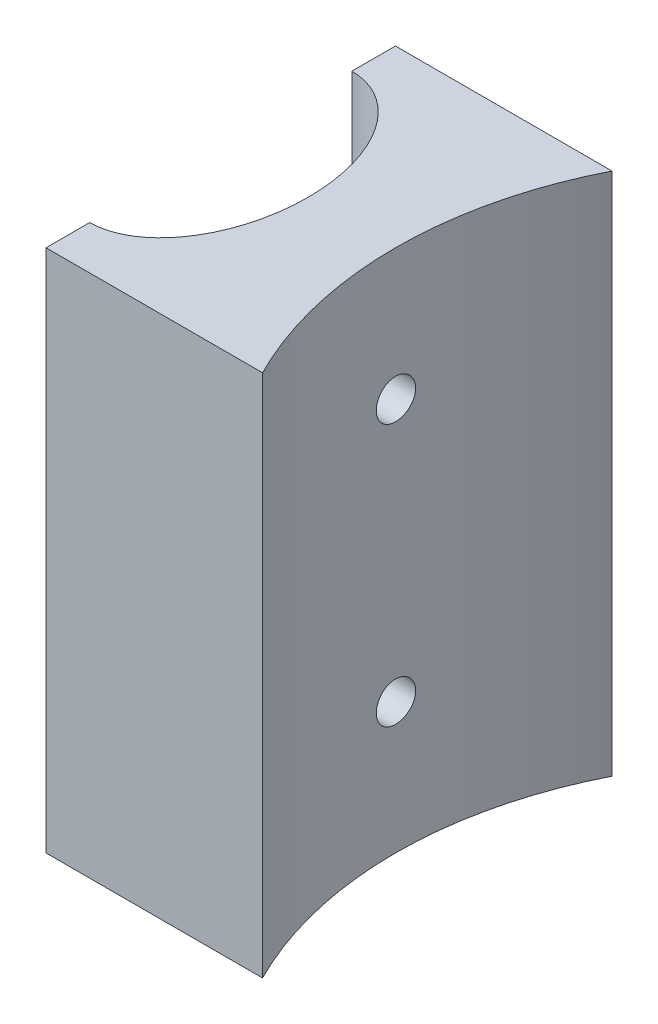
ISO-10303-21;
HEADER;
FILE_DESCRIPTION(('STEP AP214'),'2;1');
FILE_NAME('part.step','',(''),(''),'','','');
FILE_SCHEMA(('AUTOMOTIVE_DESIGN { 1 0 10303 214 1 1 1 1 }'));
ENDSEC;
DATA;
#1=APPLICATION_CONTEXT('core data for automotive mechanical design processes');
#2=APPLICATION_PROTOCOL_DEFINITION('international standard','automotive_design',2000,#1);
#3=PRODUCT_CONTEXT('',#1,'mechanical');
#4=PRODUCT('Part','Part','',(#3));
#5=PRODUCT_RELATED_PRODUCT_CATEGORY('part','',(#4));
#6=PRODUCT_DEFINITION_FORMATION('','',#4);
#7=PRODUCT_DEFINITION_CONTEXT('part definition',#1,'design');
#8=PRODUCT_DEFINITION('design','',#6,#7);
#9=PRODUCT_DEFINITION_SHAPE('','',#8);
#10=(LENGTH_UNIT() NAMED_UNIT(*) SI_UNIT(.MILLI.,.METRE.));
#11=(NAMED_UNIT(*) PLANE_ANGLE_UNIT() SI_UNIT($,.RADIAN.));
#12=(NAMED_UNIT(*) SI_UNIT($,.STERADIAN.) SOLID_ANGLE_UNIT());
#13=UNCERTAINTY_MEASURE_WITH_UNIT(LENGTH_MEASURE(1.E-05),#10,'distance_accuracy_value','');
#14=(GEOMETRIC_REPRESENTATION_CONTEXT(3) GLOBAL_UNCERTAINTY_ASSIGNED_CONTEXT((#13)) GLOBAL_UNIT_ASSIGNED_CONTEXT((#10,
#11,#12)) REPRESENTATION_CONTEXT('',''));
#15=CARTESIAN_POINT('',(0.,0.,0.));
#16=DIRECTION('',(0.,0.,1.));
#17=DIRECTION('',(1.,0.,0.));
#18=AXIS2_PLACEMENT_3D('',#15,#16,#17);
#19=CARTESIAN_POINT('',(-64.1998321537616,60.,0.));
#20=DIRECTION('',(0.,1.,0.));
#21=DIRECTION('',(0.,0.,-1.));
#22=AXIS2_PLACEMENT_3D('',#19,#20,#21);
#23=ELLIPSE('',#22,15.,10.);
#24=DIRECTION('',(0.,-1.,0.));
#25=VECTOR('',#24,1.);
#26=SURFACE_OF_LINEAR_EXTRUSION('',#23,#25);
#27=CARTESIAN_POINT('',(-54.3129721871191,45.,-2.24999999999999));
#28=CARTESIAN_POINT('',(-54.3129706872666,44.8739592523668,-2.24999454023008));
#29=CARTESIAN_POINT('',(-54.3118893348429,44.7478352137008,-2.23937347601886));
#30=CARTESIAN_POINT('',(-54.3076825072295,44.4990842417355,-2.19716456045317));
#31=CARTESIAN_POINT('',(-54.3045547802726,44.3764613162571,-2.16555361190786));
#32=CARTESIAN_POINT('',(-54.2966159529565,44.1383509595851,-2.08229495381813));
#33=CARTESIAN_POINT('',(-54.2918058771812,44.0228592356021,-2.03065943755707));
#34=CARTESIAN_POINT('',(-54.2810489830644,43.8022065304441,-1.9088406674487));
#35=CARTESIAN_POINT('',(-54.2751023899888,43.6970435082877,-1.83866108811767));
#36=CARTESIAN_POINT('',(-54.2627203591001,43.4996213484624,-1.68146848882134));
#37=CARTESIAN_POINT('',(-54.2562833840133,43.4074056016115,-1.59440108885701));
#38=CARTESIAN_POINT('',(-54.2436604444196,43.238869742639,-1.40602070373931));
#39=CARTESIAN_POINT('',(-54.2374744913362,43.1625503532773,-1.30470707120287));
#40=CARTESIAN_POINT('',(-54.226033579334,43.027825982386,-1.09044795567095));
#41=CARTESIAN_POINT('',(-54.2207805977245,42.9694588612899,-0.977478551824353));
#42=CARTESIAN_POINT('',(-54.2118109596765,42.8725383770923,-0.743280883548645));
#43=CARTESIAN_POINT('',(-54.2080942657743,42.8339845308216,-0.622052820597957));
#44=CARTESIAN_POINT('',(-54.2026235678418,42.7779113778186,-0.375214780381486));
#45=CARTESIAN_POINT('',(-54.2008629583611,42.7603212644838,-0.249621036586616));
#46=CARTESIAN_POINT('',(-54.1994785442416,42.7464556746743,0.00274753546304236));
#47=CARTESIAN_POINT('',(-54.1998546843143,42.7501796466982,0.129522333073351));
#48=CARTESIAN_POINT('',(-54.2026964369109,42.7787795846845,0.380178209009529));
#49=CARTESIAN_POINT('',(-54.2051545989741,42.8035801297554,0.504067989106644));
#50=CARTESIAN_POINT('',(-54.2118779649085,42.873511630149,0.745917749903435));
#51=CARTESIAN_POINT('',(-54.2161431919209,42.918642845827,0.863877654643423));
#52=CARTESIAN_POINT('',(-54.226017317538,43.0280368951439,1.0907565636833));
#53=CARTESIAN_POINT('',(-54.2316285523607,43.0923330402703,1.19965940041624));
#54=CARTESIAN_POINT('',(-54.2435680169262,43.2382074682986,1.40515672376701));
#55=CARTESIAN_POINT('',(-54.2498962678837,43.3197862626164,1.50175084601843));
#56=CARTESIAN_POINT('',(-54.2625935628969,43.4983362274651,1.68033271854842));
#57=CARTESIAN_POINT('',(-54.2689626641709,43.5953733033282,1.76225458531803));
#58=CARTESIAN_POINT('',(-54.2809951255089,43.8018570400412,1.90865676127198));
#59=CARTESIAN_POINT('',(-54.2866584844155,43.9113037212415,1.97313704185348));
#60=CARTESIAN_POINT('',(-54.2966359742979,44.1395537855823,2.08282690545579));
#61=CARTESIAN_POINT('',(-54.3009497867868,44.2583593691144,2.12803194051513));
#62=CARTESIAN_POINT('',(-54.3077301675247,44.50192746667,2.19783343771165));
#63=CARTESIAN_POINT('',(-54.3101967932222,44.6266897953076,2.2224305407679));
#64=CARTESIAN_POINT('',(-54.3129911866722,44.8780464433999,2.25023243673036));
#65=CARTESIAN_POINT('',(-54.3133282502384,45.0046303798506,2.25353020538985));
#66=CARTESIAN_POINT('',(-54.311849524196,45.25654901479,2.23888399232438));
#67=CARTESIAN_POINT('',(-54.3100337638153,45.3818837302156,2.22094029898678));
#68=CARTESIAN_POINT('',(-54.30446436498,45.6274733142993,2.16439873305868));
#69=CARTESIAN_POINT('',(-54.3007148790374,45.7477384731619,2.12584511208666));
#70=CARTESIAN_POINT('',(-54.2917071125229,45.9800949527236,2.02922307657604));
#71=CARTESIAN_POINT('',(-54.2864487965996,46.0921860818313,1.97115420479741));
#72=CARTESIAN_POINT('',(-54.2749964632433,46.305438569676,1.83691567640139));
#73=CARTESIAN_POINT('',(-54.2687992709233,46.4065607654607,1.76068408014213));
#74=CARTESIAN_POINT('',(-54.2561797458112,46.5946072833961,1.59237278525056));
#75=CARTESIAN_POINT('',(-54.2497574074585,46.6815312545915,1.50029269498653));
#76=CARTESIAN_POINT('',(-54.2373829377827,46.8390331808175,1.30249631954755));
#77=CARTESIAN_POINT('',(-54.2314325962882,46.9095507086041,1.19673178970384));
#78=CARTESIAN_POINT('',(-54.2206958782614,47.0318219027703,0.974807281629379));
#79=CARTESIAN_POINT('',(-54.2159094856004,47.0835758291606,0.858647447476102));
#80=CARTESIAN_POINT('',(-54.2080445793747,47.1667476029234,0.61944279914697));
#81=CARTESIAN_POINT('',(-54.204962975207,47.1982022680923,0.496410892264348));
#82=CARTESIAN_POINT('',(-54.2008392974862,47.2400032140212,0.246779593811854));
#83=CARTESIAN_POINT('',(-54.1997971668522,47.250350085548,0.12018030218679));
#84=CARTESIAN_POINT('',(-54.1998687973658,47.2496333484126,-0.13240293968782));
#85=CARTESIAN_POINT('',(-54.200973182774,47.2386628516567,-0.258387167165245));
#86=CARTESIAN_POINT('',(-54.2051963930277,47.1958180729749,-0.506713433461588));
#87=CARTESIAN_POINT('',(-54.2083152191077,47.1639437782382,-0.629055470048357));
#88=CARTESIAN_POINT('',(-54.2162207314384,47.0802220971701,-0.866623647317668));
#89=CARTESIAN_POINT('',(-54.2210071890169,47.0283774491488,-0.981850761077351));
#90=CARTESIAN_POINT('',(-54.2317177808872,46.9061968740451,-1.20198185504934));
#91=CARTESIAN_POINT('',(-54.2376419086402,46.8358610532411,-1.30688589458899));
#92=CARTESIAN_POINT('',(-54.2499975440924,46.6783459775815,-1.50387009383773));
#93=CARTESIAN_POINT('',(-54.2564310723443,46.5910974320206,-1.59589472063789));
#94=CARTESIAN_POINT('',(-54.2690641081727,46.4023698867624,-1.76403882204443));
#95=CARTESIAN_POINT('',(-54.2752635591578,46.3008874734352,-1.840154470352));
#96=CARTESIAN_POINT('',(-54.2867418183695,46.0862869292685,-1.97447506707629));
#97=CARTESIAN_POINT('',(-54.2920182165752,45.9731395296529,-2.03263342418632));
#98=CARTESIAN_POINT('',(-54.3010208352089,45.7387042205194,-2.12904785076018));
#99=CARTESIAN_POINT('',(-54.3047488030047,45.6174256673795,-2.1673263664488));
#100=CARTESIAN_POINT('',(-54.3092892487963,45.4128841769473,-2.21335293233092));
#101=CARTESIAN_POINT('',(-54.3106637572163,45.3309288090992,-2.22707678698007));
#102=CARTESIAN_POINT('',(-54.312505718371,45.1659943352491,-2.24540209934365));
#103=CARTESIAN_POINT('',(-54.3129731749789,45.0830152336201,-2.25000359601225));
#104=CARTESIAN_POINT('',(-54.3129721871191,45.,-2.24999999999999));
#105=B_SPLINE_CURVE_WITH_KNOTS('',3,(#27,#28,#29,#30,#31,#32,#33,#34,#35,#36,#37,#38,#39,#40,
#41,#42,#43,#44,#45,#46,#47,#48,#49,#50,#51,#52,#53,#54,#55,#56,#57,#58,#59,#60,#61,#62,#63,#64,
#65,#66,#67,#68,#69,#70,#71,#72,#73,#74,#75,#76,#77,#78,#79,#80,#81,#82,#83,#84,#85,#86,#87,#88,
#89,#90,#91,#92,#93,#94,#95,#96,#97,#98,#99,#100,#101,#102,#103,#104),.UNSPECIFIED.,.T.,.F.,(4,
2,2,2,2,2,2,2,2,2,2,2,2,2,2,2,2,2,2,2,2,2,2,2,2,2,2,2,2,2,2,2,2,2,2,2,2,2,4),(0.,
0.377819073818889,0.756054588858869,1.13406015088811,1.51199086700333,1.89115938009317,
2.2703451290836,2.65032516369576,3.03029593162446,3.40897964897296,3.78765356793336,
4.16497810970032,4.54230748363547,4.9202965748471,5.2982968528114,5.67795410512996,
6.05761198005278,6.43735938510403,6.81709497934432,7.19517182680597,7.5732435413192,
7.95050673859512,8.3277787757195,8.70635630419786,9.08494318903928,9.46490313597504,
9.84485781753408,10.2241214047119,10.603374376883,10.9809745371524,11.3585749288327,
11.736123562834,12.1136700269133,12.4927972850532,12.8720156231524,13.2522097556177,
13.6319736744608,13.8808207592518,14.1296667814167),.UNSPECIFIED.);
#106=CARTESIAN_POINT('',(-54.3129721871191,45.,-2.24999999999999));
#107=VERTEX_POINT('',#106);
#108=EDGE_CURVE('E46',#107,#107,#105,.T.);
#109=ORIENTED_EDGE('',*,*,#108,.F.);
#110=EDGE_LOOP('',(#109));
#111=FACE_BOUND('',#110,.T.);
#112=CARTESIAN_POINT('',(-54.3129721871191,15.,-2.24999999999999));
#113=CARTESIAN_POINT('',(-54.3129706872666,14.8739592523668,-2.24999454023008));
#114=CARTESIAN_POINT('',(-54.3118893348429,14.7478352137008,-2.23937347601886));
#115=CARTESIAN_POINT('',(-54.3076825072295,14.4990842417355,-2.19716456045318));
#116=CARTESIAN_POINT('',(-54.3045547802726,14.3764613162571,-2.16555361190788));
#117=CARTESIAN_POINT('',(-54.2966159529565,14.1383509595851,-2.08229495381814));
#118=CARTESIAN_POINT('',(-54.2918058771812,14.0228592356021,-2.03065943755708));
#119=CARTESIAN_POINT('',(-54.2810489830643,13.8022065304441,-1.90884066744871));
#120=CARTESIAN_POINT('',(-54.2751023899888,13.6970435082877,-1.83866108811768));
#121=CARTESIAN_POINT('',(-54.2627203591001,13.4996213484624,-1.68146848882135));
#122=CARTESIAN_POINT('',(-54.2562833840133,13.4074056016115,-1.59440108885702));
#123=CARTESIAN_POINT('',(-54.2436604444196,13.238869742639,-1.40602070373931));
#124=CARTESIAN_POINT('',(-54.2374744913362,13.1625503532773,-1.30470707120289));
#125=CARTESIAN_POINT('',(-54.226033579334,13.027825982386,-1.09044795567097));
#126=CARTESIAN_POINT('',(-54.2207805977245,12.9694588612899,-0.977478551824365));
#127=CARTESIAN_POINT('',(-54.2118109596765,12.8725383770923,-0.743280883548656));
#128=CARTESIAN_POINT('',(-54.2080942657743,12.8339845308216,-0.622052820597969));
#129=CARTESIAN_POINT('',(-54.2026235678418,12.7779113778186,-0.3752147803815));
#130=CARTESIAN_POINT('',(-54.2008629583611,12.7603212644838,-0.24962103658663));
#131=CARTESIAN_POINT('',(-54.1994785442416,12.7464556746743,0.00274753546302924));
#132=CARTESIAN_POINT('',(-54.1998546843143,12.7501796466982,0.129522333073338));
#133=CARTESIAN_POINT('',(-54.2026964369109,12.7787795846845,0.380178209009516));
#134=CARTESIAN_POINT('',(-54.2051545989741,12.8035801297554,0.504067989106631));
#135=CARTESIAN_POINT('',(-54.2118779649085,12.873511630149,0.745917749903422));
#136=CARTESIAN_POINT('',(-54.2161431919209,12.9186428458269,0.86387765464341));
#137=CARTESIAN_POINT('',(-54.226017317538,13.0280368951439,1.09075656368329));
#138=CARTESIAN_POINT('',(-54.2316285523607,13.0923330402703,1.19965940041623));
#139=CARTESIAN_POINT('',(-54.2435680169262,13.2382074682985,1.40515672376699));
#140=CARTESIAN_POINT('',(-54.2498962678837,13.3197862626164,1.50175084601842));
#141=CARTESIAN_POINT('',(-54.2625935628969,13.4983362274651,1.68033271854841));
#142=CARTESIAN_POINT('',(-54.2689626641709,13.5953733033282,1.76225458531803));
#143=CARTESIAN_POINT('',(-54.2809951255089,13.8018570400412,1.90865676127198));
#144=CARTESIAN_POINT('',(-54.2866584844155,13.9113037212415,1.97313704185348));
#145=CARTESIAN_POINT('',(-54.2966359742979,14.1395537855823,2.08282690545579));
#146=CARTESIAN_POINT('',(-54.3009497867868,14.2583593691144,2.12803194051513));
#147=CARTESIAN_POINT('',(-54.3077301675247,14.50192746667,2.19783343771165));
#148=CARTESIAN_POINT('',(-54.3101967932222,14.6266897953076,2.2224305407679));
#149=CARTESIAN_POINT('',(-54.3129911866722,14.8780464433999,2.25023243673036));
#150=CARTESIAN_POINT('',(-54.3133282502384,15.0046303798505,2.25353020538985));
#151=CARTESIAN_POINT('',(-54.311849524196,15.25654901479,2.23888399232439));
#152=CARTESIAN_POINT('',(-54.3100337638153,15.3818837302156,2.22094029898678));
#153=CARTESIAN_POINT('',(-54.30446436498,15.6274733142993,2.16439873305868));
#154=CARTESIAN_POINT('',(-54.3007148790374,15.7477384731619,2.12584511208666));
#155=CARTESIAN_POINT('',(-54.2917071125229,15.9800949527236,2.02922307657604));
#156=CARTESIAN_POINT('',(-54.2864487965996,16.0921860818313,1.97115420479742));
#157=CARTESIAN_POINT('',(-54.2749964632433,16.3054385696761,1.8369156764014));
#158=CARTESIAN_POINT('',(-54.2687992709233,16.4065607654607,1.76068408014214));
#159=CARTESIAN_POINT('',(-54.2561797458112,16.5946072833961,1.59237278525056));
#160=CARTESIAN_POINT('',(-54.2497574074585,16.6815312545915,1.50029269498652));
#161=CARTESIAN_POINT('',(-54.2373829377827,16.8390331808175,1.30249631954755));
#162=CARTESIAN_POINT('',(-54.2314325962882,16.9095507086041,1.19673178970384));
#163=CARTESIAN_POINT('',(-54.2206958782614,17.0318219027703,0.974807281629389));
#164=CARTESIAN_POINT('',(-54.2159094856004,17.0835758291606,0.858647447476114));
#165=CARTESIAN_POINT('',(-54.2080445793747,17.1667476029234,0.619442799146983));
#166=CARTESIAN_POINT('',(-54.204962975207,17.1982022680923,0.496410892264362));
#167=CARTESIAN_POINT('',(-54.2008392974862,17.2400032140212,0.246779593811868));
#168=CARTESIAN_POINT('',(-54.1997971668522,17.250350085548,0.120180302186804));
#169=CARTESIAN_POINT('',(-54.1998687973658,17.2496333484126,-0.132402939687807));
#170=CARTESIAN_POINT('',(-54.200973182774,17.2386628516567,-0.258387167165233));
#171=CARTESIAN_POINT('',(-54.2051963930277,17.1958180729749,-0.506713433461575));
#172=CARTESIAN_POINT('',(-54.2083152191077,17.1639437782382,-0.629055470048343));
#173=CARTESIAN_POINT('',(-54.2162207314384,17.0802220971701,-0.866623647317656));
#174=CARTESIAN_POINT('',(-54.2210071890169,17.0283774491488,-0.981850761077344));
#175=CARTESIAN_POINT('',(-54.2317177808872,16.9061968740451,-1.20198185504934));
#176=CARTESIAN_POINT('',(-54.2376419086402,16.8358610532411,-1.30688589458899));
#177=CARTESIAN_POINT('',(-54.2499975440924,16.6783459775815,-1.50387009383773));
#178=CARTESIAN_POINT('',(-54.2564310723443,16.5910974320206,-1.59589472063789));
#179=CARTESIAN_POINT('',(-54.2690641081727,16.4023698867624,-1.76403882204443));
#180=CARTESIAN_POINT('',(-54.2752635591578,16.3008874734352,-1.840154470352));
#181=CARTESIAN_POINT('',(-54.2867418183695,16.0862869292686,-1.97447506707628));
#182=CARTESIAN_POINT('',(-54.2920182165752,15.9731395296529,-2.03263342418632));
#183=CARTESIAN_POINT('',(-54.3010208352089,15.7387042205194,-2.12904785076018));
#184=CARTESIAN_POINT('',(-54.3047488030047,15.6174256673795,-2.1673263664488));
#185=CARTESIAN_POINT('',(-54.3092892487963,15.4128841769473,-2.21335293233092));
#186=CARTESIAN_POINT('',(-54.3106637572163,15.3309288090992,-2.22707678698008));
#187=CARTESIAN_POINT('',(-54.312505718371,15.1659943352491,-2.24540209934365));
#188=CARTESIAN_POINT('',(-54.3129731749789,15.0830152336201,-2.25000359601226));
#189=CARTESIAN_POINT('',(-54.3129721871191,15.,-2.24999999999999));
#190=B_SPLINE_CURVE_WITH_KNOTS('',3,(#112,#113,#114,#115,#116,#117,#118,#119,#120,#121,#122,
#123,#124,#125,#126,#127,#128,#129,#130,#131,#132,#133,#134,#135,#136,#137,#138,#139,#140,#141,
#142,#143,#144,#145,#146,#147,#148,#149,#150,#151,#152,#153,#154,#155,#156,#157,#158,#159,#160,
#161,#162,#163,#164,#165,#166,#167,#168,#169,#170,#171,#172,#173,#174,#175,#176,#177,#178,#179,
#180,#181,#182,#183,#184,#185,#186,#187,#188,#189),.UNSPECIFIED.,.T.,.F.,(4,2,2,2,2,2,2,2,2,2,2,
2,2,2,2,2,2,2,2,2,2,2,2,2,2,2,2,2,2,2,2,2,2,2,2,2,2,2,4),(0.,0.377819073818889,
0.756054588858866,1.1340601508881,1.51199086700332,1.89115938009317,2.27034512908359,
2.65032516369575,3.03029593162446,3.40897964897296,3.78765356793336,4.16497810970031,
4.54230748363546,4.9202965748471,5.29829685281139,5.67795410512996,6.05761198005279,
6.43735938510404,6.81709497934432,7.19517182680597,7.5732435413192,7.95050673859512,
8.3277787757195,8.70635630419787,9.08494318903929,9.46490313597504,9.84485781753408,
10.2241214047119,10.603374376883,10.9809745371524,11.3585749288327,11.736123562834,
12.1136700269133,12.4927972850532,12.8720156231524,13.2522097556177,13.6319736744608,
13.8808207592518,14.1296667814167),.UNSPECIFIED.);
#191=CARTESIAN_POINT('',(-54.3129721871191,15.,-2.24999999999999));
#192=VERTEX_POINT('',#191);
#193=EDGE_CURVE('E164',#192,#192,#190,.T.);
#194=ORIENTED_EDGE('',*,*,#193,.F.);
#195=EDGE_LOOP('',(#194));
#196=FACE_BOUND('',#195,.T.);
#197=CARTESIAN_POINT('',(-64.1998321537616,0.,0.));
#198=DIRECTION('',(0.,1.,0.));
#199=DIRECTION('',(0.,0.,-1.));
#200=AXIS2_PLACEMENT_3D('',#197,#198,#199);
#201=ELLIPSE('',#200,15.,10.);
#202=CARTESIAN_POINT('',(-64.1998321537616,0.,15.));
#203=VERTEX_POINT('',#202);
#204=CARTESIAN_POINT('',(-64.1998321537616,0.,-15.));
#205=VERTEX_POINT('',#204);
#206=EDGE_CURVE('E135',#203,#205,#201,.T.);
#207=ORIENTED_EDGE('',*,*,#206,.F.);
#208=DIRECTION('',(0.,-1.,0.));
#209=VECTOR('',#208,1.);
#210=CARTESIAN_POINT('',(-64.1998321537616,60.,15.));
#211=LINE('',#210,#209);
#212=CARTESIAN_POINT('',(-64.1998321537616,60.,15.));
#213=VERTEX_POINT('',#212);
#214=EDGE_CURVE('E11',#213,#203,#211,.T.);
#215=ORIENTED_EDGE('',*,*,#214,.F.);
#216=CARTESIAN_POINT('',(-64.1998321537616,60.,-15.));
#217=VERTEX_POINT('',#216);
#218=EDGE_CURVE('E155',#213,#217,#23,.T.);
#219=ORIENTED_EDGE('',*,*,#218,.T.);
#220=DIRECTION('',(0.,-1.,0.));
#221=VECTOR('',#220,1.);
#222=CARTESIAN_POINT('',(-64.1998321537616,60.,-15.));
#223=LINE('',#222,#221);
#224=EDGE_CURVE('E66',#217,#205,#223,.T.);
#225=ORIENTED_EDGE('',*,*,#224,.T.);
#226=EDGE_LOOP('',(#207,#215,#219,#225));
#227=FACE_BOUND('',#226,.T.);
#228=ADVANCED_FACE('F41',(#111,#196,#227),#26,.T.);
#229=CARTESIAN_POINT('',(-64.1998321537616,60.,0.));
#230=DIRECTION('',(1.,0.,0.));
#231=DIRECTION('',(0.,0.,-1.));
#232=AXIS2_PLACEMENT_3D('',#229,#230,#231);
#233=PLANE('',#232);
#234=DIRECTION('',(0.,0.,1.));
#235=VECTOR('',#234,1.);
#236=CARTESIAN_POINT('',(-64.1998321537616,0.,0.));
#237=LINE('',#236,#235);
#238=CARTESIAN_POINT('',(-64.1998321537616,0.,20.));
#239=VERTEX_POINT('',#238);
#240=EDGE_CURVE('E138',#203,#239,#237,.T.);
#241=ORIENTED_EDGE('',*,*,#240,.T.);
#242=DIRECTION('',(0.,-1.,0.));
#243=VECTOR('',#242,1.);
#244=CARTESIAN_POINT('',(-64.1998321537616,60.,20.));
#245=LINE('',#244,#243);
#246=CARTESIAN_POINT('',(-64.1998321537616,60.,20.));
#247=VERTEX_POINT('',#246);
#248=EDGE_CURVE('E57',#247,#239,#245,.T.);
#249=ORIENTED_EDGE('',*,*,#248,.F.);
#250=DIRECTION('',(0.,0.,1.));
#251=VECTOR('',#250,1.);
#252=CARTESIAN_POINT('',(-64.1998321537616,60.,0.));
#253=LINE('',#252,#251);
#254=EDGE_CURVE('E290',#213,#247,#253,.T.);
#255=ORIENTED_EDGE('',*,*,#254,.F.);
#256=ORIENTED_EDGE('',*,*,#214,.T.);
#257=EDGE_LOOP('',(#241,#249,#255,#256));
#258=FACE_BOUND('',#257,.T.);
#259=ADVANCED_FACE('F204',(#258),#233,.F.);
#260=CARTESIAN_POINT('',(0.,60.,20.));
#261=DIRECTION('',(0.,0.,-1.));
#262=DIRECTION('',(-1.,0.,0.));
#263=AXIS2_PLACEMENT_3D('',#260,#261,#262);
#264=PLANE('',#263);
#265=DIRECTION('',(1.,0.,0.));
#266=VECTOR('',#265,1.);
#267=CARTESIAN_POINT('',(0.,0.,20.));
#268=LINE('',#267,#266);
#269=CARTESIAN_POINT('',(-39.4160520907498,0.,20.));
#270=VERTEX_POINT('',#269);
#271=EDGE_CURVE('E142',#239,#270,#268,.T.);
#272=ORIENTED_EDGE('',*,*,#271,.T.);
#273=DIRECTION('',(0.,-1.,0.));
#274=VECTOR('',#273,1.);
#275=CARTESIAN_POINT('',(-39.4160520907498,60.,20.));
#276=LINE('',#275,#274);
#277=CARTESIAN_POINT('',(-39.4160520907498,60.,20.));
#278=VERTEX_POINT('',#277);
#279=EDGE_CURVE('E114',#278,#270,#276,.T.);
#280=ORIENTED_EDGE('',*,*,#279,.F.);
#281=DIRECTION('',(1.,0.,0.));
#282=VECTOR('',#281,1.);
#283=CARTESIAN_POINT('',(0.,60.,20.));
#284=LINE('',#283,#282);
#285=EDGE_CURVE('E123',#247,#278,#284,.T.);
#286=ORIENTED_EDGE('',*,*,#285,.F.);
#287=ORIENTED_EDGE('',*,*,#248,.T.);
#288=EDGE_LOOP('',(#272,#280,#286,#287));
#289=FACE_BOUND('',#288,.T.);
#290=ADVANCED_FACE('F199',(#289),#264,.F.);
#291=CARTESIAN_POINT('',(0.,60.,0.));
#292=DIRECTION('',(0.,-1.,0.));
#293=DIRECTION('',(0.,0.,-1.));
#294=AXIS2_PLACEMENT_3D('',#291,#292,#293);
#295=CYLINDRICAL_SURFACE('',#294,44.1998321537616);
#296=CARTESIAN_POINT('',(-44.1425266882255,45.,-2.24999999999998));
#297=CARTESIAN_POINT('',(-44.142527457818,45.1262956092506,-2.24999442713911));
#298=CARTESIAN_POINT('',(-44.1430745282501,45.2526807103639,-2.23933056294759));
#299=CARTESIAN_POINT('',(-44.1452040744582,45.5019641712585,-2.19694165198085));
#300=CARTESIAN_POINT('',(-44.1467877692082,45.6248582481824,-2.16519180941065));
#301=CARTESIAN_POINT('',(-44.1508107094823,45.8635124793692,-2.08154253460701));
#302=CARTESIAN_POINT('',(-44.1532495178031,45.9792762437347,-2.02965339776952));
#303=CARTESIAN_POINT('',(-44.1587073290967,46.2004192475668,-1.90721433747127));
#304=CARTESIAN_POINT('',(-44.1617261953374,46.3058009254783,-1.83666881025444));
#305=CARTESIAN_POINT('',(-44.1680075556287,46.5033297005833,-1.67883757395632));
#306=CARTESIAN_POINT('',(-44.1712702699331,46.5954646077047,-1.59153661631729));
#307=CARTESIAN_POINT('',(-44.177669607545,46.7637805125193,-1.40270322416019));
#308=CARTESIAN_POINT('',(-44.1808062256941,46.839960858079,-1.30117020819809));
#309=CARTESIAN_POINT('',(-44.1866016205701,46.9742389013147,-1.08669080106702));
#310=CARTESIAN_POINT('',(-44.1892601454235,47.0323270792366,-0.973738442520186));
#311=CARTESIAN_POINT('',(-44.1937975398201,47.1287107849185,-0.739668658279781));
#312=CARTESIAN_POINT('',(-44.1956764154222,47.1670064664935,-0.618551296047801));
#313=CARTESIAN_POINT('',(-44.1984413086293,47.2226858367235,-0.371701952053489));
#314=CARTESIAN_POINT('',(-44.1993281938033,47.24008779946,-0.245974102065903));
#315=CARTESIAN_POINT('',(-44.2000120742315,47.2535421520233,0.00662110096752594));
#316=CARTESIAN_POINT('',(-44.1998090783036,47.2495947145811,0.133488444785809));
#317=CARTESIAN_POINT('',(-44.1983368021044,47.2204774794499,0.38463759539406));
#318=CARTESIAN_POINT('',(-44.1970685100674,47.1953273506044,0.508921689106154));
#319=CARTESIAN_POINT('',(-44.1936096331313,47.1245491441282,0.75150168034481));
#320=CARTESIAN_POINT('',(-44.1914190442614,47.0789209783353,0.869797552088355));
#321=CARTESIAN_POINT('',(-44.186360620201,46.9684594984692,1.09710643121945));
#322=CARTESIAN_POINT('',(-44.1834924692291,46.9036172259702,1.20611507791987));
#323=CARTESIAN_POINT('',(-44.1774019054214,46.7565747085047,1.41170749108833));
#324=CARTESIAN_POINT('',(-44.1741794899872,46.6743743362294,1.50829116642015));
#325=CARTESIAN_POINT('',(-44.1677389591943,46.4948378001546,1.68640669954388));
#326=CARTESIAN_POINT('',(-44.1645208528609,46.3974845712613,1.76792135741352));
#327=CARTESIAN_POINT('',(-44.1584554139715,46.1904657630216,1.91345244421067));
#328=CARTESIAN_POINT('',(-44.1556080815165,46.0808001803134,1.97746886836012));
#329=CARTESIAN_POINT('',(-44.1506055642542,45.8522592519534,2.08618481168339));
#330=CARTESIAN_POINT('',(-44.1484504028022,45.7333835957012,2.13088367905763));
#331=CARTESIAN_POINT('',(-44.1450761544198,45.4898016742682,2.19968415845908));
#332=CARTESIAN_POINT('',(-44.143857060192,45.3650954545494,2.22378593105792));
#333=CARTESIAN_POINT('',(-44.1424937742406,45.113542202159,2.25068677682164));
#334=CARTESIAN_POINT('',(-44.142348377821,44.9866977288993,2.25350972504169));
#335=CARTESIAN_POINT('',(-44.143145738618,44.7343369052879,2.23783509858044));
#336=CARTESIAN_POINT('',(-44.1440884921024,44.6088205503822,2.21933759702648));
#337=CARTESIAN_POINT('',(-44.1469547967472,44.3627460072776,2.16156695099568));
#338=CARTESIAN_POINT('',(-44.1488778317838,44.2421852459907,2.12230473884765));
#339=CARTESIAN_POINT('',(-44.153487519395,44.0093648948898,2.02413024679334));
#340=CARTESIAN_POINT('',(-44.156174176552,43.8971053548971,1.96521784896457));
#341=CARTESIAN_POINT('',(-44.1620112320942,43.6839642547279,1.82935403455678));
#342=CARTESIAN_POINT('',(-44.1651620417669,43.5830929271795,1.75238658311025));
#343=CARTESIAN_POINT('',(-44.1715708316232,43.3956945597139,1.58262090573441));
#344=CARTESIAN_POINT('',(-44.1748288125155,43.3091676146683,1.48982257511028));
#345=CARTESIAN_POINT('',(-44.1810882652372,43.1528339388415,1.29092678535638));
#346=CARTESIAN_POINT('',(-44.184089498821,43.0830426317282,1.18481719459108));
#347=CARTESIAN_POINT('',(-44.1894938119399,42.9622667993887,0.96237224846879));
#348=CARTESIAN_POINT('',(-44.1918968941494,42.9112821900752,0.846036938835211));
#349=CARTESIAN_POINT('',(-44.1958329415064,42.8295939790179,0.606500219686937));
#350=CARTESIAN_POINT('',(-44.1973663296369,42.7988805170388,0.483302179993526));
#351=CARTESIAN_POINT('',(-44.1993918614039,42.7585741537844,0.233489978314401));
#352=CARTESIAN_POINT('',(-44.1998840111988,42.7489811275917,0.106875836537806));
#353=CARTESIAN_POINT('',(-44.1997716291172,42.751189137305,-0.146021400601056));
#354=CARTESIAN_POINT('',(-44.1991683372368,42.7629659833628,-0.272304708428289));
#355=CARTESIAN_POINT('',(-44.196935426664,42.807529421899,-0.521098748328215));
#356=CARTESIAN_POINT('',(-44.1953058060454,42.8403160538052,-0.643609473320685));
#357=CARTESIAN_POINT('',(-44.1912035689077,42.9259633831783,-0.8813856723419));
#358=CARTESIAN_POINT('',(-44.1887309468382,42.9788242128135,-0.996651098661936));
#359=CARTESIAN_POINT('',(-44.1832207559317,43.1031152891248,-1.21667263128502));
#360=CARTESIAN_POINT('',(-44.1801832042624,43.1745449715365,-1.3214290567983));
#361=CARTESIAN_POINT('',(-44.1738810919513,43.3340329762259,-1.5175799377965));
#362=CARTESIAN_POINT('',(-44.1706163025094,43.422108216098,-1.60896062979999));
#363=CARTESIAN_POINT('',(-44.1642292526021,43.6123750413224,-1.77566792429637));
#364=CARTESIAN_POINT('',(-44.1611070273895,43.7145700932879,-1.85099057272869));
#365=CARTESIAN_POINT('',(-44.1553551002149,43.9302583525554,-1.98348031376508));
#366=CARTESIAN_POINT('',(-44.152725882865,44.0437625103267,-2.04062958046435));
#367=CARTESIAN_POINT('',(-44.1482641292806,44.2786834892356,-2.13499164743612));
#368=CARTESIAN_POINT('',(-44.1464306530198,44.4000907780917,-2.17222798343416));
#369=CARTESIAN_POINT('',(-44.1442523316723,44.6018763667702,-2.21594575059408));
#370=CARTESIAN_POINT('',(-44.1436080717631,44.6809478249356,-2.22869977646528));
#371=CARTESIAN_POINT('',(-44.1427450064325,44.8400008814801,-2.245728662801));
#372=CARTESIAN_POINT('',(-44.1425262006323,44.9199824790486,-2.25000353081562));
#373=CARTESIAN_POINT('',(-44.1425266882255,45.,-2.24999999999998));
#374=B_SPLINE_CURVE_WITH_KNOTS('',3,(#296,#297,#298,#299,#300,#301,#302,#303,#304,#305,#306,
#307,#308,#309,#310,#311,#312,#313,#314,#315,#316,#317,#318,#319,#320,#321,#322,#323,#324,#325,
#326,#327,#328,#329,#330,#331,#332,#333,#334,#335,#336,#337,#338,#339,#340,#341,#342,#343,#344,
#345,#346,#347,#348,#349,#350,#351,#352,#353,#354,#355,#356,#357,#358,#359,#360,#361,#362,#363,
#364,#365,#366,#367,#368,#369,#370,#371,#372,#373),.UNSPECIFIED.,.T.,.F.,(4,2,2,2,2,2,2,2,2,2,2,
2,2,2,2,2,2,2,2,2,2,2,2,2,2,2,2,2,2,2,2,2,2,2,2,2,2,2,4),(0.,0.378594731734978,
0.757635457421965,1.13648266861811,1.51524068662206,1.89434504826529,2.27346490255521,
2.65278390679091,3.03209996315123,3.41108401955544,3.79006500972879,4.16869482156635,
4.54732626350176,4.92613451787348,5.30494555061657,5.68418632769206,6.06342720832306,
6.44268088403758,6.82193160312444,7.20075673565692,7.57958056885506,7.95820515487461,
8.33683201309433,8.7157964151361,9.09476332349142,9.47407815923131,9.85339129898401,
10.2325197980464,10.6116460547362,10.9903434232201,11.3690415023837,11.7477420749304,
12.1264311409865,12.5055071751526,12.8846764437643,13.2642164928182,13.6433069543771,
13.883174666591,14.1230421652195),.UNSPECIFIED.);
#375=CARTESIAN_POINT('',(-44.1425266882255,45.,-2.24999999999998));
#376=VERTEX_POINT('',#375);
#377=EDGE_CURVE('E171',#376,#376,#374,.T.);
#378=ORIENTED_EDGE('',*,*,#377,.F.);
#379=EDGE_LOOP('',(#378));
#380=FACE_BOUND('',#379,.T.);
#381=CARTESIAN_POINT('',(-44.1425266882255,15.,-2.24999999999999));
#382=CARTESIAN_POINT('',(-44.142527457818,15.1262956092506,-2.24999442713911));
#383=CARTESIAN_POINT('',(-44.1430745282501,15.2526807103639,-2.23933056294759));
#384=CARTESIAN_POINT('',(-44.1452040744582,15.5019641712585,-2.19694165198085));
#385=CARTESIAN_POINT('',(-44.1467877692082,15.6248582481824,-2.16519180941066));
#386=CARTESIAN_POINT('',(-44.1508107094823,15.8635124793692,-2.08154253460701));
#387=CARTESIAN_POINT('',(-44.1532495178031,15.9792762437347,-2.02965339776952));
#388=CARTESIAN_POINT('',(-44.1587073290967,16.2004192475668,-1.90721433747127));
#389=CARTESIAN_POINT('',(-44.1617261953374,16.3058009254783,-1.83666881025444));
#390=CARTESIAN_POINT('',(-44.1680075556287,16.5033297005833,-1.67883757395632));
#391=CARTESIAN_POINT('',(-44.1712702699331,16.5954646077047,-1.59153661631728));
#392=CARTESIAN_POINT('',(-44.177669607545,16.7637805125193,-1.40270322416019));
#393=CARTESIAN_POINT('',(-44.1808062256941,16.839960858079,-1.30117020819809));
#394=CARTESIAN_POINT('',(-44.1866016205701,16.9742389013147,-1.08669080106701));
#395=CARTESIAN_POINT('',(-44.1892601454235,17.0323270792366,-0.97373844252018));
#396=CARTESIAN_POINT('',(-44.1937975398201,17.1287107849185,-0.739668658279774));
#397=CARTESIAN_POINT('',(-44.1956764154222,17.1670064664935,-0.618551296047795));
#398=CARTESIAN_POINT('',(-44.1984413086293,17.2226858367235,-0.371701952053484));
#399=CARTESIAN_POINT('',(-44.1993281938033,17.24008779946,-0.2459741020659));
#400=CARTESIAN_POINT('',(-44.2000120742315,17.2535421520233,0.00662110096752891));
#401=CARTESIAN_POINT('',(-44.1998090783036,17.2495947145811,0.133488444785812));
#402=CARTESIAN_POINT('',(-44.1983368021044,17.2204774794499,0.384637595394062));
#403=CARTESIAN_POINT('',(-44.1970685100674,17.1953273506044,0.508921689106156));
#404=CARTESIAN_POINT('',(-44.1936096331313,17.1245491441282,0.751501680344812));
#405=CARTESIAN_POINT('',(-44.1914190442614,17.0789209783353,0.869797552088358));
#406=CARTESIAN_POINT('',(-44.186360620201,16.9684594984692,1.09710643121945));
#407=CARTESIAN_POINT('',(-44.1834924692291,16.9036172259702,1.20611507791988));
#408=CARTESIAN_POINT('',(-44.1774019054214,16.7565747085047,1.41170749108834));
#409=CARTESIAN_POINT('',(-44.1741794899872,16.6743743362294,1.50829116642015));
#410=CARTESIAN_POINT('',(-44.1677389591943,16.4948378001546,1.68640669954388));
#411=CARTESIAN_POINT('',(-44.1645208528609,16.3974845712613,1.76792135741352));
#412=CARTESIAN_POINT('',(-44.1584554139715,16.1904657630216,1.91345244421068));
#413=CARTESIAN_POINT('',(-44.1556080815165,16.0808001803134,1.97746886836012));
#414=CARTESIAN_POINT('',(-44.1506055642542,15.8522592519534,2.08618481168339));
#415=CARTESIAN_POINT('',(-44.1484504028022,15.7333835957012,2.13088367905763));
#416=CARTESIAN_POINT('',(-44.1450761544198,15.4898016742682,2.19968415845908));
#417=CARTESIAN_POINT('',(-44.143857060192,15.3650954545494,2.22378593105792));
#418=CARTESIAN_POINT('',(-44.1424937742406,15.113542202159,2.25068677682164));
#419=CARTESIAN_POINT('',(-44.142348377821,14.9866977288993,2.25350972504169));
#420=CARTESIAN_POINT('',(-44.143145738618,14.7343369052879,2.23783509858044));
#421=CARTESIAN_POINT('',(-44.1440884921024,14.6088205503822,2.21933759702648));
#422=CARTESIAN_POINT('',(-44.1469547967472,14.3627460072776,2.16156695099568));
#423=CARTESIAN_POINT('',(-44.1488778317838,14.2421852459907,2.12230473884765));
#424=CARTESIAN_POINT('',(-44.153487519395,14.0093648948898,2.02413024679334));
#425=CARTESIAN_POINT('',(-44.156174176552,13.8971053548971,1.96521784896458));
#426=CARTESIAN_POINT('',(-44.1620112320942,13.6839642547279,1.82935403455678));
#427=CARTESIAN_POINT('',(-44.1651620417669,13.5830929271795,1.75238658311025));
#428=CARTESIAN_POINT('',(-44.1715708316232,13.3956945597139,1.58262090573441));
#429=CARTESIAN_POINT('',(-44.1748288125155,13.3091676146683,1.48982257511027));
#430=CARTESIAN_POINT('',(-44.1810882652372,13.1528339388415,1.29092678535638));
#431=CARTESIAN_POINT('',(-44.184089498821,13.0830426317282,1.18481719459108));
#432=CARTESIAN_POINT('',(-44.1894938119399,12.9622667993887,0.962372248468785));
#433=CARTESIAN_POINT('',(-44.1918968941494,12.9112821900752,0.846036938835206));
#434=CARTESIAN_POINT('',(-44.1958329415064,12.8295939790179,0.606500219686932));
#435=CARTESIAN_POINT('',(-44.1973663296369,12.7988805170388,0.483302179993523));
#436=CARTESIAN_POINT('',(-44.1993918614039,12.7585741537844,0.233489978314401));
#437=CARTESIAN_POINT('',(-44.1998840111988,12.7489811275917,0.106875836537806));
#438=CARTESIAN_POINT('',(-44.1997716291172,12.751189137305,-0.146021400601055));
#439=CARTESIAN_POINT('',(-44.1991683372368,12.7629659833628,-0.272304708428289));
#440=CARTESIAN_POINT('',(-44.196935426664,12.807529421899,-0.521098748328216));
#441=CARTESIAN_POINT('',(-44.1953058060454,12.8403160538051,-0.643609473320686));
#442=CARTESIAN_POINT('',(-44.1912035689077,12.9259633831783,-0.881385672341902));
#443=CARTESIAN_POINT('',(-44.1887309468382,12.9788242128135,-0.996651098661936));
#444=CARTESIAN_POINT('',(-44.1832207559317,13.1031152891248,-1.21667263128502));
#445=CARTESIAN_POINT('',(-44.1801832042624,13.1745449715365,-1.3214290567983));
#446=CARTESIAN_POINT('',(-44.1738810919513,13.3340329762259,-1.5175799377965));
#447=CARTESIAN_POINT('',(-44.1706163025094,13.422108216098,-1.60896062979999));
#448=CARTESIAN_POINT('',(-44.1642292526021,13.6123750413224,-1.77566792429638));
#449=CARTESIAN_POINT('',(-44.1611070273895,13.7145700932879,-1.85099057272869));
#450=CARTESIAN_POINT('',(-44.1553551002149,13.9302583525554,-1.98348031376509));
#451=CARTESIAN_POINT('',(-44.152725882865,14.0437625103267,-2.04062958046435));
#452=CARTESIAN_POINT('',(-44.1482641292806,14.2786834892356,-2.13499164743612));
#453=CARTESIAN_POINT('',(-44.1464306530198,14.4000907780917,-2.17222798343416));
#454=CARTESIAN_POINT('',(-44.1442523316723,14.6018763667702,-2.21594575059408));
#455=CARTESIAN_POINT('',(-44.1436080717631,14.6809478249356,-2.22869977646528));
#456=CARTESIAN_POINT('',(-44.1427450064325,14.8400008814801,-2.24572866280101));
#457=CARTESIAN_POINT('',(-44.1425262006323,14.9199824790486,-2.25000353081562));
#458=CARTESIAN_POINT('',(-44.1425266882255,15.,-2.24999999999999));
#459=B_SPLINE_CURVE_WITH_KNOTS('',3,(#381,#382,#383,#384,#385,#386,#387,#388,#389,#390,#391,
#392,#393,#394,#395,#396,#397,#398,#399,#400,#401,#402,#403,#404,#405,#406,#407,#408,#409,#410,
#411,#412,#413,#414,#415,#416,#417,#418,#419,#420,#421,#422,#423,#424,#425,#426,#427,#428,#429,
#430,#431,#432,#433,#434,#435,#436,#437,#438,#439,#440,#441,#442,#443,#444,#445,#446,#447,#448,
#449,#450,#451,#452,#453,#454,#455,#456,#457,#458),.UNSPECIFIED.,.T.,.F.,(4,2,2,2,2,2,2,2,2,2,2,
2,2,2,2,2,2,2,2,2,2,2,2,2,2,2,2,2,2,2,2,2,2,2,2,2,2,2,4),(0.,0.378594731734978,
0.757635457421969,1.13648266861811,1.51524068662206,1.8943450482653,2.27346490255521,
2.65278390679092,3.03209996315124,3.41108401955545,3.7900650097288,4.16869482156635,
4.54732626350177,4.92613451787349,5.30494555061657,5.68418632769207,6.06342720832306,
6.44268088403759,6.82193160312445,7.20075673565692,7.57958056885508,7.95820515487461,
8.33683201309434,8.71579641513612,9.09476332349143,9.47407815923132,9.85339129898402,
10.2325197980464,10.6116460547362,10.9903434232201,11.3690415023837,11.7477420749305,
12.1264311409865,12.5055071751527,12.8846764437644,13.2642164928182,13.6433069543771,
13.8831746665911,14.1230421652195),.UNSPECIFIED.);
#460=CARTESIAN_POINT('',(-44.1425266882255,15.,-2.24999999999999));
#461=VERTEX_POINT('',#460);
#462=EDGE_CURVE('E139',#461,#461,#459,.T.);
#463=ORIENTED_EDGE('',*,*,#462,.F.);
#464=EDGE_LOOP('',(#463));
#465=FACE_BOUND('',#464,.T.);
#466=CARTESIAN_POINT('',(0.,0.,0.));
#467=DIRECTION('',(0.,1.,0.));
#468=DIRECTION('',(0.,0.,1.));
#469=AXIS2_PLACEMENT_3D('',#466,#467,#468);
#470=CIRCLE('',#469,44.1998321537616);
#471=CARTESIAN_POINT('',(-39.4160520907498,0.,-20.));
#472=VERTEX_POINT('',#471);
#473=EDGE_CURVE('E109',#472,#270,#470,.T.);
#474=ORIENTED_EDGE('',*,*,#473,.F.);
#475=DIRECTION('',(0.,-1.,0.));
#476=VECTOR('',#475,1.);
#477=CARTESIAN_POINT('',(-39.4160520907498,60.,-20.));
#478=LINE('',#477,#476);
#479=CARTESIAN_POINT('',(-39.4160520907498,60.,-20.));
#480=VERTEX_POINT('',#479);
#481=EDGE_CURVE('E104',#480,#472,#478,.T.);
#482=ORIENTED_EDGE('',*,*,#481,.F.);
#483=CARTESIAN_POINT('',(0.,60.,0.));
#484=DIRECTION('',(0.,1.,0.));
#485=DIRECTION('',(0.,0.,1.));
#486=AXIS2_PLACEMENT_3D('',#483,#484,#485);
#487=CIRCLE('',#486,44.1998321537616);
#488=EDGE_CURVE('E107',#480,#278,#487,.T.);
#489=ORIENTED_EDGE('',*,*,#488,.T.);
#490=ORIENTED_EDGE('',*,*,#279,.T.);
#491=EDGE_LOOP('',(#474,#482,#489,#490));
#492=FACE_BOUND('',#491,.T.);
#493=ADVANCED_FACE('F106',(#380,#465,#492),#295,.F.);
#494=CARTESIAN_POINT('',(0.,60.,-20.));
#495=DIRECTION('',(0.,0.,-1.));
#496=DIRECTION('',(-1.,0.,0.));
#497=AXIS2_PLACEMENT_3D('',#494,#495,#496);
#498=PLANE('',#497);
#499=DIRECTION('',(1.,0.,0.));
#500=VECTOR('',#499,1.);
#501=CARTESIAN_POINT('',(0.,0.,-20.));
#502=LINE('',#501,#500);
#503=CARTESIAN_POINT('',(-64.1998321537616,0.,-20.));
#504=VERTEX_POINT('',#503);
#505=EDGE_CURVE('E148',#504,#472,#502,.T.);
#506=ORIENTED_EDGE('',*,*,#505,.F.);
#507=DIRECTION('',(0.,-1.,0.));
#508=VECTOR('',#507,1.);
#509=CARTESIAN_POINT('',(-64.1998321537616,60.,-20.));
#510=LINE('',#509,#508);
#511=CARTESIAN_POINT('',(-64.1998321537616,60.,-20.));
#512=VERTEX_POINT('',#511);
#513=EDGE_CURVE('E85',#512,#504,#510,.T.);
#514=ORIENTED_EDGE('',*,*,#513,.F.);
#515=DIRECTION('',(1.,0.,0.));
#516=VECTOR('',#515,1.);
#517=CARTESIAN_POINT('',(0.,60.,-20.));
#518=LINE('',#517,#516);
#519=EDGE_CURVE('E121',#512,#480,#518,.T.);
#520=ORIENTED_EDGE('',*,*,#519,.T.);
#521=ORIENTED_EDGE('',*,*,#481,.T.);
#522=EDGE_LOOP('',(#506,#514,#520,#521));
#523=FACE_BOUND('',#522,.T.);
#524=ADVANCED_FACE('F127',(#523),#498,.T.);
#525=CARTESIAN_POINT('',(-64.1998321537616,60.,0.));
#526=DIRECTION('',(-1.,0.,0.));
#527=DIRECTION('',(0.,0.,1.));
#528=AXIS2_PLACEMENT_3D('',#525,#526,#527);
#529=PLANE('',#528);
#530=DIRECTION('',(0.,0.,-1.));
#531=VECTOR('',#530,1.);
#532=CARTESIAN_POINT('',(-64.1998321537616,0.,0.));
#533=LINE('',#532,#531);
#534=EDGE_CURVE('E151',#205,#504,#533,.T.);
#535=ORIENTED_EDGE('',*,*,#534,.F.);
#536=ORIENTED_EDGE('',*,*,#224,.F.);
#537=DIRECTION('',(0.,0.,-1.));
#538=VECTOR('',#537,1.);
#539=CARTESIAN_POINT('',(-64.1998321537616,60.,0.));
#540=LINE('',#539,#538);
#541=EDGE_CURVE('E129',#217,#512,#540,.T.);
#542=ORIENTED_EDGE('',*,*,#541,.T.);
#543=ORIENTED_EDGE('',*,*,#513,.T.);
#544=EDGE_LOOP('',(#535,#536,#542,#543));
#545=FACE_BOUND('',#544,.T.);
#546=ADVANCED_FACE('F216',(#545),#529,.T.);
#547=CARTESIAN_POINT('',(0.,60.,0.));
#548=DIRECTION('',(0.,1.,0.));
#549=DIRECTION('',(0.,0.,1.));
#550=AXIS2_PLACEMENT_3D('',#547,#548,#549);
#551=PLANE('',#550);
#552=ORIENTED_EDGE('',*,*,#218,.F.);
#553=ORIENTED_EDGE('',*,*,#254,.T.);
#554=ORIENTED_EDGE('',*,*,#285,.T.);
#555=ORIENTED_EDGE('',*,*,#488,.F.);
#556=ORIENTED_EDGE('',*,*,#519,.F.);
#557=ORIENTED_EDGE('',*,*,#541,.F.);
#558=EDGE_LOOP('',(#552,#553,#554,#555,#556,#557));
#559=FACE_BOUND('',#558,.T.);
#560=ADVANCED_FACE('F119',(#559),#551,.T.);
#561=CARTESIAN_POINT('',(0.,0.,0.));
#562=DIRECTION('',(0.,1.,0.));
#563=DIRECTION('',(0.,0.,1.));
#564=AXIS2_PLACEMENT_3D('',#561,#562,#563);
#565=PLANE('',#564);
#566=ORIENTED_EDGE('',*,*,#206,.T.);
#567=ORIENTED_EDGE('',*,*,#534,.T.);
#568=ORIENTED_EDGE('',*,*,#505,.T.);
#569=ORIENTED_EDGE('',*,*,#473,.T.);
#570=ORIENTED_EDGE('',*,*,#271,.F.);
#571=ORIENTED_EDGE('',*,*,#240,.F.);
#572=EDGE_LOOP('',(#566,#567,#568,#569,#570,#571));
#573=FACE_BOUND('',#572,.T.);
#574=ADVANCED_FACE('F177',(#573),#565,.F.);
#575=CARTESIAN_POINT('',(0.,15.,0.));
#576=DIRECTION('',(1.,0.,0.));
#577=DIRECTION('',(0.,0.,-1.));
#578=AXIS2_PLACEMENT_3D('',#575,#576,#577);
#579=CYLINDRICAL_SURFACE('',#578,2.24999999999999);
#580=ORIENTED_EDGE('',*,*,#462,.T.);
#581=EDGE_LOOP('',(#580));
#582=FACE_BOUND('',#581,.T.);
#583=ORIENTED_EDGE('',*,*,#193,.T.);
#584=EDGE_LOOP('',(#583));
#585=FACE_BOUND('',#584,.T.);
#586=ADVANCED_FACE('F172',(#582,#585),#579,.F.);
#587=CARTESIAN_POINT('',(0.,45.,0.));
#588=DIRECTION('',(1.,0.,0.));
#589=DIRECTION('',(0.,0.,-1.));
#590=AXIS2_PLACEMENT_3D('',#587,#588,#589);
#591=CYLINDRICAL_SURFACE('',#590,2.24999999999998);
#592=ORIENTED_EDGE('',*,*,#377,.T.);
#593=EDGE_LOOP('',(#592));
#594=FACE_BOUND('',#593,.T.);
#595=ORIENTED_EDGE('',*,*,#108,.T.);
#596=EDGE_LOOP('',(#595));
#597=FACE_BOUND('',#596,.T.);
#598=ADVANCED_FACE('F176',(#594,#597),#591,.F.);
#599=CLOSED_SHELL('',(#228,#259,#290,#493,#524,#546,#560,#574,#586,#598));
#600=MANIFOLD_SOLID_BREP('B2',#599);
#601=ADVANCED_BREP_SHAPE_REPRESENTATION('',(#18,#600),#14);
#602=SHAPE_DEFINITION_REPRESENTATION(#9,#601);
ENDSEC;
END-ISO-10303-21;
